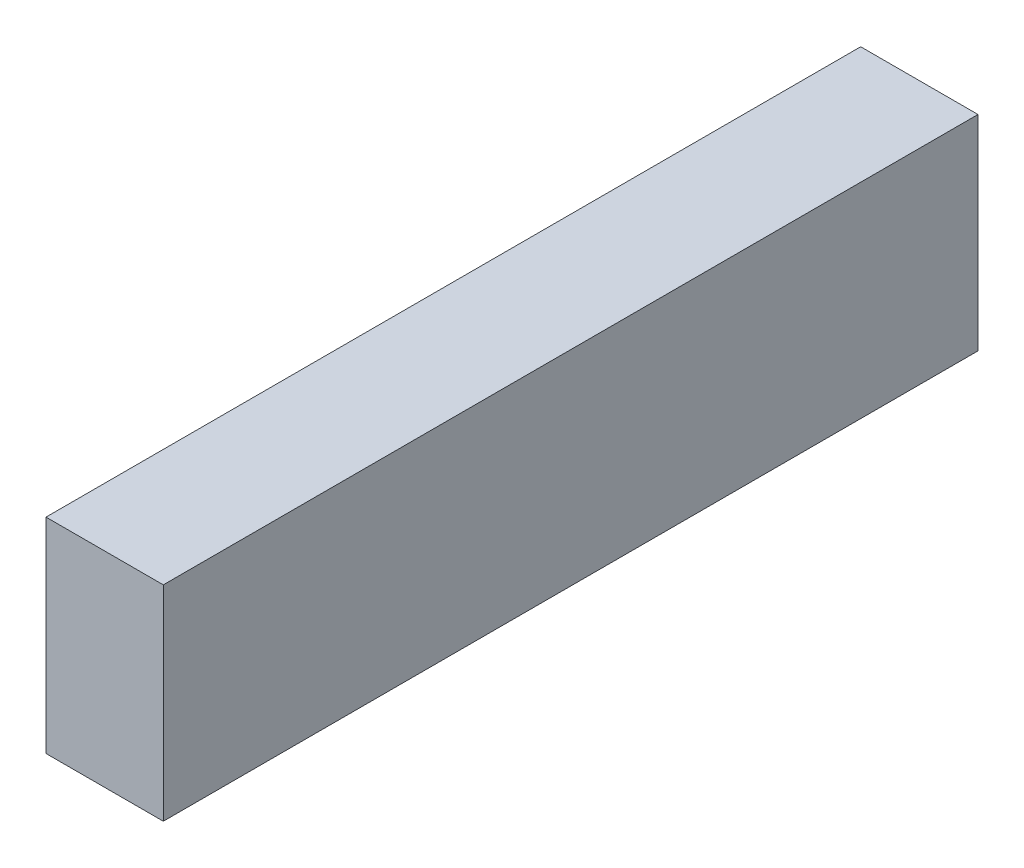
ISO-10303-21;
HEADER;
FILE_DESCRIPTION(('STEP AP214'),'2;1');
FILE_NAME('part.step','',(''),(''),'','','');
FILE_SCHEMA(('AUTOMOTIVE_DESIGN { 1 0 10303 214 1 1 1 1 }'));
ENDSEC;
DATA;
#1=APPLICATION_CONTEXT('core data for automotive mechanical design processes');
#2=APPLICATION_PROTOCOL_DEFINITION('international standard','automotive_design',2000,#1);
#3=PRODUCT_CONTEXT('',#1,'mechanical');
#4=PRODUCT('Part','Part','',(#3));
#5=PRODUCT_RELATED_PRODUCT_CATEGORY('part','',(#4));
#6=PRODUCT_DEFINITION_FORMATION('','',#4);
#7=PRODUCT_DEFINITION_CONTEXT('part definition',#1,'design');
#8=PRODUCT_DEFINITION('design','',#6,#7);
#9=PRODUCT_DEFINITION_SHAPE('','',#8);
#10=(LENGTH_UNIT() NAMED_UNIT(*) SI_UNIT(.MILLI.,.METRE.));
#11=(NAMED_UNIT(*) PLANE_ANGLE_UNIT() SI_UNIT($,.RADIAN.));
#12=(NAMED_UNIT(*) SI_UNIT($,.STERADIAN.) SOLID_ANGLE_UNIT());
#13=UNCERTAINTY_MEASURE_WITH_UNIT(LENGTH_MEASURE(1.E-05),#10,'distance_accuracy_value','');
#14=(GEOMETRIC_REPRESENTATION_CONTEXT(3) GLOBAL_UNCERTAINTY_ASSIGNED_CONTEXT((#13)) GLOBAL_UNIT_ASSIGNED_CONTEXT((#10,
#11,#12)) REPRESENTATION_CONTEXT('',''));
#15=CARTESIAN_POINT('',(0.,0.,0.));
#16=DIRECTION('',(0.,0.,1.));
#17=DIRECTION('',(1.,0.,0.));
#18=AXIS2_PLACEMENT_3D('',#15,#16,#17);
#19=CARTESIAN_POINT('',(0.,0.,50.));
#20=DIRECTION('',(1.,0.,0.));
#21=DIRECTION('',(0.,0.,-1.));
#22=AXIS2_PLACEMENT_3D('',#19,#20,#21);
#23=PLANE('',#22);
#24=DIRECTION('',(0.,-1.,0.));
#25=VECTOR('',#24,1.);
#26=CARTESIAN_POINT('',(0.,0.,0.));
#27=LINE('',#26,#25);
#28=CARTESIAN_POINT('',(0.,12.566,0.));
#29=VERTEX_POINT('',#28);
#30=CARTESIAN_POINT('',(0.,0.,0.));
#31=VERTEX_POINT('',#30);
#32=EDGE_CURVE('E107',#29,#31,#27,.T.);
#33=ORIENTED_EDGE('',*,*,#32,.T.);
#34=DIRECTION('',(0.,0.,-1.));
#35=VECTOR('',#34,1.);
#36=CARTESIAN_POINT('',(0.,0.,50.));
#37=LINE('',#36,#35);
#38=CARTESIAN_POINT('',(0.,0.,50.));
#39=VERTEX_POINT('',#38);
#40=EDGE_CURVE('E11',#39,#31,#37,.T.);
#41=ORIENTED_EDGE('',*,*,#40,.F.);
#42=DIRECTION('',(0.,-1.,0.));
#43=VECTOR('',#42,1.);
#44=CARTESIAN_POINT('',(0.,0.,50.));
#45=LINE('',#44,#43);
#46=CARTESIAN_POINT('',(0.,12.566,50.));
#47=VERTEX_POINT('',#46);
#48=EDGE_CURVE('E91',#47,#39,#45,.T.);
#49=ORIENTED_EDGE('',*,*,#48,.F.);
#50=DIRECTION('',(0.,0.,-1.));
#51=VECTOR('',#50,1.);
#52=CARTESIAN_POINT('',(0.,12.566,50.));
#53=LINE('',#52,#51);
#54=EDGE_CURVE('E103',#47,#29,#53,.T.);
#55=ORIENTED_EDGE('',*,*,#54,.T.);
#56=EDGE_LOOP('',(#33,#41,#49,#55));
#57=FACE_BOUND('',#56,.T.);
#58=ADVANCED_FACE('F39',(#57),#23,.F.);
#59=CARTESIAN_POINT('',(0.,0.,50.));
#60=DIRECTION('',(0.,1.,0.));
#61=DIRECTION('',(-1.,0.,0.));
#62=AXIS2_PLACEMENT_3D('',#59,#60,#61);
#63=PLANE('',#62);
#64=DIRECTION('',(1.,0.,0.));
#65=VECTOR('',#64,1.);
#66=CARTESIAN_POINT('',(0.,0.,0.));
#67=LINE('',#66,#65);
#68=CARTESIAN_POINT('',(7.2,0.,0.));
#69=VERTEX_POINT('',#68);
#70=EDGE_CURVE('E96',#31,#69,#67,.T.);
#71=ORIENTED_EDGE('',*,*,#70,.T.);
#72=DIRECTION('',(0.,0.,-1.));
#73=VECTOR('',#72,1.);
#74=CARTESIAN_POINT('',(7.2,0.,50.));
#75=LINE('',#74,#73);
#76=CARTESIAN_POINT('',(7.2,0.,50.));
#77=VERTEX_POINT('',#76);
#78=EDGE_CURVE('E48',#77,#69,#75,.T.);
#79=ORIENTED_EDGE('',*,*,#78,.F.);
#80=DIRECTION('',(1.,0.,0.));
#81=VECTOR('',#80,1.);
#82=CARTESIAN_POINT('',(0.,0.,50.));
#83=LINE('',#82,#81);
#84=EDGE_CURVE('E86',#39,#77,#83,.T.);
#85=ORIENTED_EDGE('',*,*,#84,.F.);
#86=ORIENTED_EDGE('',*,*,#40,.T.);
#87=EDGE_LOOP('',(#71,#79,#85,#86));
#88=FACE_BOUND('',#87,.T.);
#89=ADVANCED_FACE('F95',(#88),#63,.F.);
#90=CARTESIAN_POINT('',(7.2,0.,50.));
#91=DIRECTION('',(-1.,0.,0.));
#92=DIRECTION('',(0.,-1.,0.));
#93=AXIS2_PLACEMENT_3D('',#90,#91,#92);
#94=PLANE('',#93);
#95=DIRECTION('',(0.,1.,0.));
#96=VECTOR('',#95,1.);
#97=CARTESIAN_POINT('',(7.2,0.,0.));
#98=LINE('',#97,#96);
#99=CARTESIAN_POINT('',(7.2,12.566,0.));
#100=VERTEX_POINT('',#99);
#101=EDGE_CURVE('E73',#69,#100,#98,.T.);
#102=ORIENTED_EDGE('',*,*,#101,.T.);
#103=DIRECTION('',(0.,0.,-1.));
#104=VECTOR('',#103,1.);
#105=CARTESIAN_POINT('',(7.2,12.566,50.));
#106=LINE('',#105,#104);
#107=CARTESIAN_POINT('',(7.2,12.566,50.));
#108=VERTEX_POINT('',#107);
#109=EDGE_CURVE('E98',#108,#100,#106,.T.);
#110=ORIENTED_EDGE('',*,*,#109,.F.);
#111=DIRECTION('',(0.,1.,0.));
#112=VECTOR('',#111,1.);
#113=CARTESIAN_POINT('',(7.2,0.,50.));
#114=LINE('',#113,#112);
#115=EDGE_CURVE('E89',#77,#108,#114,.T.);
#116=ORIENTED_EDGE('',*,*,#115,.F.);
#117=ORIENTED_EDGE('',*,*,#78,.T.);
#118=EDGE_LOOP('',(#102,#110,#116,#117));
#119=FACE_BOUND('',#118,.T.);
#120=ADVANCED_FACE('F99',(#119),#94,.F.);
#121=CARTESIAN_POINT('',(0.,12.566,50.));
#122=DIRECTION('',(0.,-1.,0.));
#123=DIRECTION('',(1.,0.,0.));
#124=AXIS2_PLACEMENT_3D('',#121,#122,#123);
#125=PLANE('',#124);
#126=DIRECTION('',(-1.,0.,0.));
#127=VECTOR('',#126,1.);
#128=CARTESIAN_POINT('',(0.,12.566,0.));
#129=LINE('',#128,#127);
#130=EDGE_CURVE('E79',#100,#29,#129,.T.);
#131=ORIENTED_EDGE('',*,*,#130,.T.);
#132=ORIENTED_EDGE('',*,*,#54,.F.);
#133=DIRECTION('',(-1.,0.,0.));
#134=VECTOR('',#133,1.);
#135=CARTESIAN_POINT('',(0.,12.566,50.));
#136=LINE('',#135,#134);
#137=EDGE_CURVE('E56',#108,#47,#136,.T.);
#138=ORIENTED_EDGE('',*,*,#137,.F.);
#139=ORIENTED_EDGE('',*,*,#109,.T.);
#140=EDGE_LOOP('',(#131,#132,#138,#139));
#141=FACE_BOUND('',#140,.T.);
#142=ADVANCED_FACE('F120',(#141),#125,.F.);
#143=CARTESIAN_POINT('',(0.,0.,50.));
#144=DIRECTION('',(0.,0.,-1.));
#145=DIRECTION('',(-1.,0.,0.));
#146=AXIS2_PLACEMENT_3D('',#143,#144,#145);
#147=PLANE('',#146);
#148=ORIENTED_EDGE('',*,*,#48,.T.);
#149=ORIENTED_EDGE('',*,*,#84,.T.);
#150=ORIENTED_EDGE('',*,*,#115,.T.);
#151=ORIENTED_EDGE('',*,*,#137,.T.);
#152=EDGE_LOOP('',(#148,#149,#150,#151));
#153=FACE_BOUND('',#152,.T.);
#154=ADVANCED_FACE('F87',(#153),#147,.F.);
#155=CARTESIAN_POINT('',(0.,0.,0.));
#156=DIRECTION('',(0.,0.,-1.));
#157=DIRECTION('',(-1.,0.,0.));
#158=AXIS2_PLACEMENT_3D('',#155,#156,#157);
#159=PLANE('',#158);
#160=ORIENTED_EDGE('',*,*,#32,.F.);
#161=ORIENTED_EDGE('',*,*,#130,.F.);
#162=ORIENTED_EDGE('',*,*,#101,.F.);
#163=ORIENTED_EDGE('',*,*,#70,.F.);
#164=EDGE_LOOP('',(#160,#161,#162,#163));
#165=FACE_BOUND('',#164,.T.);
#166=ADVANCED_FACE('F123',(#165),#159,.T.);
#167=CLOSED_SHELL('',(#58,#89,#120,#142,#154,#166));
#168=MANIFOLD_SOLID_BREP('B2',#167);
#169=ADVANCED_BREP_SHAPE_REPRESENTATION('',(#18,#168),#14);
#170=SHAPE_DEFINITION_REPRESENTATION(#9,#169);
ENDSEC;
END-ISO-10303-21;
